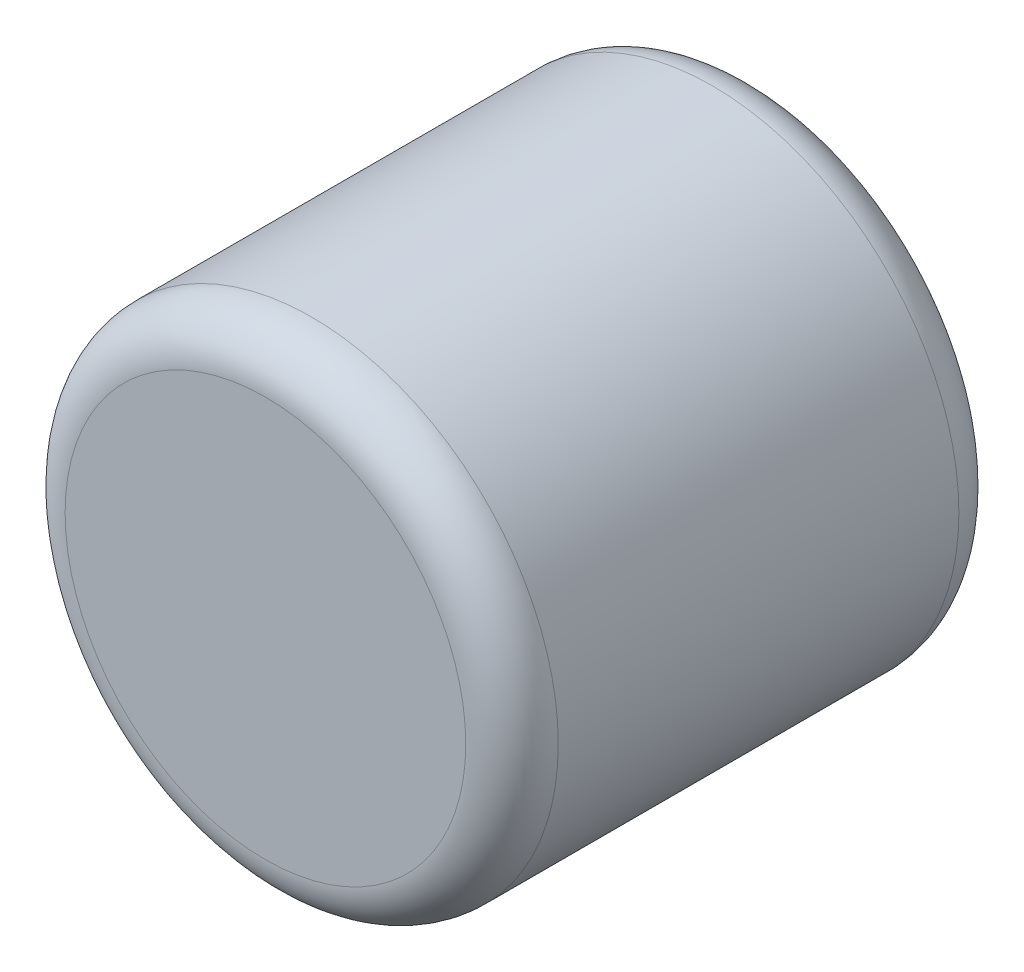
ISO-10303-21;
HEADER;
FILE_DESCRIPTION(('STEP AP214'),'2;1');
FILE_NAME('part.step','',(''),(''),'','','');
FILE_SCHEMA(('AUTOMOTIVE_DESIGN { 1 0 10303 214 1 1 1 1 }'));
ENDSEC;
DATA;
#1=APPLICATION_CONTEXT('core data for automotive mechanical design processes');
#2=APPLICATION_PROTOCOL_DEFINITION('international standard','automotive_design',2000,#1);
#3=PRODUCT_CONTEXT('',#1,'mechanical');
#4=PRODUCT('Part','Part','',(#3));
#5=PRODUCT_RELATED_PRODUCT_CATEGORY('part','',(#4));
#6=PRODUCT_DEFINITION_FORMATION('','',#4);
#7=PRODUCT_DEFINITION_CONTEXT('part definition',#1,'design');
#8=PRODUCT_DEFINITION('design','',#6,#7);
#9=PRODUCT_DEFINITION_SHAPE('','',#8);
#10=(LENGTH_UNIT() NAMED_UNIT(*) SI_UNIT(.MILLI.,.METRE.));
#11=(NAMED_UNIT(*) PLANE_ANGLE_UNIT() SI_UNIT($,.RADIAN.));
#12=(NAMED_UNIT(*) SI_UNIT($,.STERADIAN.) SOLID_ANGLE_UNIT());
#13=UNCERTAINTY_MEASURE_WITH_UNIT(LENGTH_MEASURE(1.E-05),#10,'distance_accuracy_value','');
#14=(GEOMETRIC_REPRESENTATION_CONTEXT(3) GLOBAL_UNCERTAINTY_ASSIGNED_CONTEXT((#13)) GLOBAL_UNIT_ASSIGNED_CONTEXT((#10,
#11,#12)) REPRESENTATION_CONTEXT('',''));
#15=CARTESIAN_POINT('',(0.,0.,0.));
#16=DIRECTION('',(0.,0.,1.));
#17=DIRECTION('',(1.,0.,0.));
#18=AXIS2_PLACEMENT_3D('',#15,#16,#17);
#19=CARTESIAN_POINT('',(0.,0.,-0.8));
#20=DIRECTION('',(0.,0.,1.));
#21=DIRECTION('',(1.,0.,0.));
#22=AXIS2_PLACEMENT_3D('',#19,#20,#21);
#23=PLANE('',#22);
#24=CARTESIAN_POINT('',(0.,0.,-0.8));
#25=DIRECTION('',(0.,0.,1.));
#26=DIRECTION('',(-0.999999801206386,-0.000630545152403891,0.));
#27=AXIS2_PLACEMENT_3D('',#24,#25,#26);
#28=CIRCLE('',#27,0.649999999999993);
#29=CARTESIAN_POINT('',(-0.64999993131961,-0.000204248479243492,-0.8));
#30=VERTEX_POINT('',#29);
#31=CARTESIAN_POINT('',(0.649999935780506,0.000204071232607627,-0.8));
#32=VERTEX_POINT('',#31);
#33=EDGE_CURVE('E46',#30,#32,#28,.T.);
#34=ORIENTED_EDGE('',*,*,#33,.F.);
#35=CARTESIAN_POINT('',(0.,0.,-0.8));
#36=DIRECTION('',(0.,0.,1.));
#37=DIRECTION('',(0.999999802401869,0.000628646342261507,0.));
#38=AXIS2_PLACEMENT_3D('',#35,#36,#37);
#39=CIRCLE('',#38,0.649999999999985);
#40=EDGE_CURVE('E51',#32,#30,#39,.T.);
#41=ORIENTED_EDGE('',*,*,#40,.F.);
#42=EDGE_LOOP('',(#34,#41));
#43=FACE_BOUND('',#42,.T.);
#44=ADVANCED_FACE('F17',(#43),#23,.F.);
#45=CARTESIAN_POINT('',(0.,0.,0.8));
#46=DIRECTION('',(0.,0.,1.));
#47=DIRECTION('',(1.,0.,0.));
#48=AXIS2_PLACEMENT_3D('',#45,#46,#47);
#49=PLANE('',#48);
#50=CARTESIAN_POINT('',(0.,0.,0.8));
#51=DIRECTION('',(0.,0.,-1.));
#52=DIRECTION('',(-1.,0.,0.));
#53=AXIS2_PLACEMENT_3D('',#50,#51,#52);
#54=CIRCLE('',#53,0.65);
#55=CARTESIAN_POINT('',(-0.65,0.,0.8));
#56=VERTEX_POINT('',#55);
#57=CARTESIAN_POINT('',(0.65,0.,0.8));
#58=VERTEX_POINT('',#57);
#59=EDGE_CURVE('E55',#56,#58,#54,.T.);
#60=ORIENTED_EDGE('',*,*,#59,.F.);
#61=CARTESIAN_POINT('',(0.,0.,0.8));
#62=DIRECTION('',(0.,0.,-1.));
#63=DIRECTION('',(1.,0.,0.));
#64=AXIS2_PLACEMENT_3D('',#61,#62,#63);
#65=CIRCLE('',#64,0.65);
#66=EDGE_CURVE('E37',#56,#58,#65,.F.);
#67=ORIENTED_EDGE('',*,*,#66,.T.);
#68=EDGE_LOOP('',(#60,#67));
#69=FACE_BOUND('',#68,.T.);
#70=ADVANCED_FACE('F80',(#69),#49,.T.);
#71=CARTESIAN_POINT('',(0.,0.,-0.65));
#72=DIRECTION('',(0.,0.,1.));
#73=DIRECTION('',(-0.999999801206386,-0.000630545152403891,0.));
#74=AXIS2_PLACEMENT_3D('',#71,#72,#73);
#75=TOROIDAL_SURFACE('',#74,0.65,0.15);
#76=CARTESIAN_POINT('',(0.,0.,-0.65));
#77=DIRECTION('',(0.,0.,1.));
#78=DIRECTION('',(1.,0.,0.));
#79=AXIS2_PLACEMENT_3D('',#76,#77,#78);
#80=CIRCLE('',#79,0.8);
#81=CARTESIAN_POINT('',(0.8,0.,-0.65));
#82=VERTEX_POINT('',#81);
#83=EDGE_CURVE('E29',#82,#82,#80,.T.);
#84=ORIENTED_EDGE('',*,*,#83,.F.);
#85=EDGE_LOOP('',(#84));
#86=FACE_BOUND('',#85,.T.);
#87=ORIENTED_EDGE('',*,*,#33,.T.);
#88=ORIENTED_EDGE('',*,*,#40,.T.);
#89=EDGE_LOOP('',(#87,#88));
#90=FACE_BOUND('',#89,.T.);
#91=ADVANCED_FACE('F50',(#86,#90),#75,.T.);
#92=CARTESIAN_POINT('',(0.,0.,0.65));
#93=DIRECTION('',(0.,0.,1.));
#94=DIRECTION('',(0.999999901488725,-0.000443872210789011,0.));
#95=AXIS2_PLACEMENT_3D('',#92,#93,#94);
#96=TOROIDAL_SURFACE('',#95,0.65,0.15);
#97=CARTESIAN_POINT('',(0.,0.,0.65));
#98=DIRECTION('',(0.,0.,1.));
#99=DIRECTION('',(1.,0.,0.));
#100=AXIS2_PLACEMENT_3D('',#97,#98,#99);
#101=CIRCLE('',#100,0.8);
#102=CARTESIAN_POINT('',(0.8,0.,0.65));
#103=VERTEX_POINT('',#102);
#104=EDGE_CURVE('E11',#103,#103,#101,.F.);
#105=ORIENTED_EDGE('',*,*,#104,.F.);
#106=EDGE_LOOP('',(#105));
#107=FACE_BOUND('',#106,.T.);
#108=ORIENTED_EDGE('',*,*,#66,.F.);
#109=ORIENTED_EDGE('',*,*,#59,.T.);
#110=EDGE_LOOP('',(#108,#109));
#111=FACE_BOUND('',#110,.T.);
#112=ADVANCED_FACE('F79',(#107,#111),#96,.T.);
#113=CARTESIAN_POINT('',(0.,0.,-0.8));
#114=DIRECTION('',(0.,0.,1.));
#115=DIRECTION('',(1.,0.,0.));
#116=AXIS2_PLACEMENT_3D('',#113,#114,#115);
#117=CYLINDRICAL_SURFACE('',#116,0.8);
#118=ORIENTED_EDGE('',*,*,#83,.T.);
#119=EDGE_LOOP('',(#118));
#120=FACE_BOUND('',#119,.T.);
#121=ORIENTED_EDGE('',*,*,#104,.T.);
#122=EDGE_LOOP('',(#121));
#123=FACE_BOUND('',#122,.T.);
#124=ADVANCED_FACE('F121',(#120,#123),#117,.T.);
#125=CLOSED_SHELL('',(#44,#70,#91,#112,#124));
#126=MANIFOLD_SOLID_BREP('B1',#125);
#127=ADVANCED_BREP_SHAPE_REPRESENTATION('',(#18,#126),#14);
#128=SHAPE_DEFINITION_REPRESENTATION(#9,#127);
ENDSEC;
END-ISO-10303-21;
